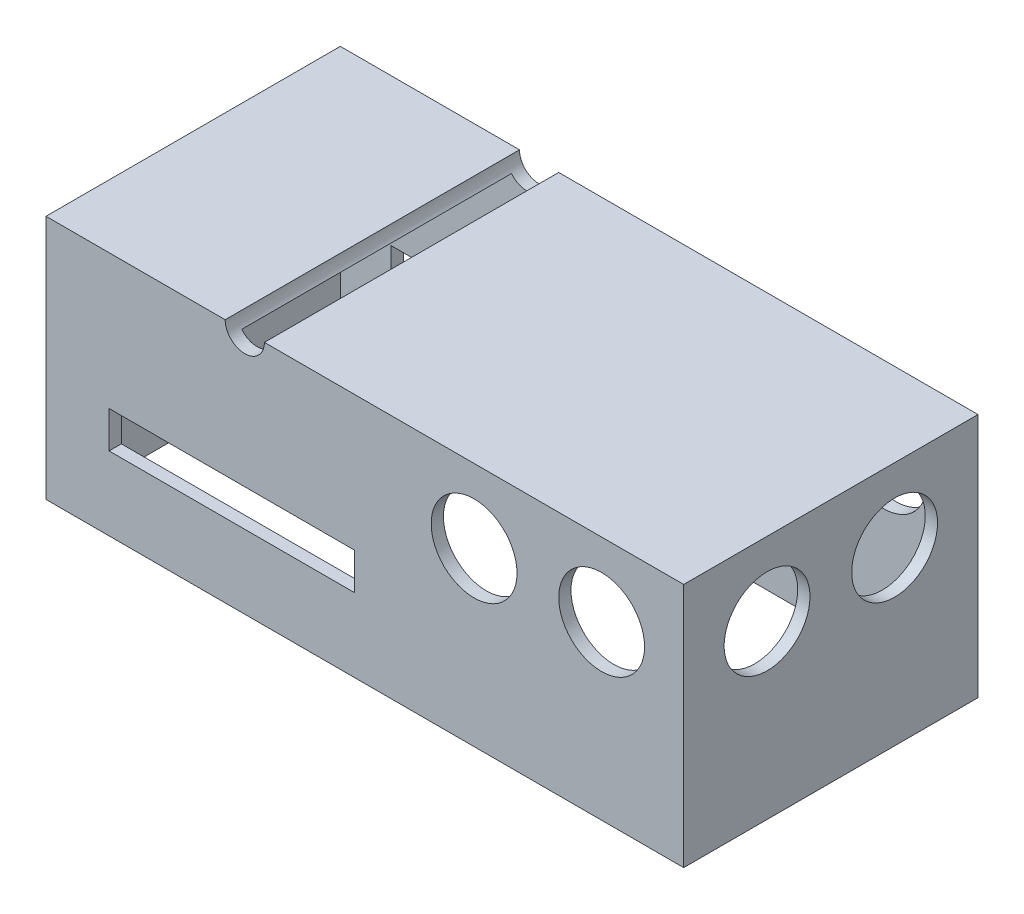
ISO-10303-21;
HEADER;
FILE_DESCRIPTION(('STEP AP214'),'2;1');
FILE_NAME('part.step','',(''),(''),'','','');
FILE_SCHEMA(('AUTOMOTIVE_DESIGN { 1 0 10303 214 1 1 1 1 }'));
ENDSEC;
DATA;
#1=APPLICATION_CONTEXT('core data for automotive mechanical design processes');
#2=APPLICATION_PROTOCOL_DEFINITION('international standard','automotive_design',2000,#1);
#3=PRODUCT_CONTEXT('',#1,'mechanical');
#4=PRODUCT('Part','Part','',(#3));
#5=PRODUCT_RELATED_PRODUCT_CATEGORY('part','',(#4));
#6=PRODUCT_DEFINITION_FORMATION('','',#4);
#7=PRODUCT_DEFINITION_CONTEXT('part definition',#1,'design');
#8=PRODUCT_DEFINITION('design','',#6,#7);
#9=PRODUCT_DEFINITION_SHAPE('','',#8);
#10=(LENGTH_UNIT() NAMED_UNIT(*) SI_UNIT(.MILLI.,.METRE.));
#11=(NAMED_UNIT(*) PLANE_ANGLE_UNIT() SI_UNIT($,.RADIAN.));
#12=(NAMED_UNIT(*) SI_UNIT($,.STERADIAN.) SOLID_ANGLE_UNIT());
#13=UNCERTAINTY_MEASURE_WITH_UNIT(LENGTH_MEASURE(1.E-05),#10,'distance_accuracy_value','');
#14=(GEOMETRIC_REPRESENTATION_CONTEXT(3) GLOBAL_UNCERTAINTY_ASSIGNED_CONTEXT((#13)) GLOBAL_UNIT_ASSIGNED_CONTEXT((#10,
#11,#12)) REPRESENTATION_CONTEXT('',''));
#15=CARTESIAN_POINT('',(0.,0.,0.));
#16=DIRECTION('',(0.,0.,1.));
#17=DIRECTION('',(1.,0.,0.));
#18=AXIS2_PLACEMENT_3D('',#15,#16,#17);
#19=CARTESIAN_POINT('',(0.,50.,0.));
#20=DIRECTION('',(0.,1.,0.));
#21=DIRECTION('',(0.,0.,1.));
#22=AXIS2_PLACEMENT_3D('',#19,#20,#21);
#23=PLANE('',#22);
#24=DIRECTION('',(0.,0.,-1.));
#25=VECTOR('',#24,1.);
#26=CARTESIAN_POINT('',(-20.4757563553922,50.,30.));
#27=LINE('',#26,#25);
#28=CARTESIAN_POINT('',(-20.4757563553922,50.,30.));
#29=VERTEX_POINT('',#28);
#30=CARTESIAN_POINT('',(-20.4757563553922,50.,-30.));
#31=VERTEX_POINT('',#30);
#32=EDGE_CURVE('E176',#29,#31,#27,.T.);
#33=ORIENTED_EDGE('',*,*,#32,.F.);
#34=DIRECTION('',(1.,0.,0.));
#35=VECTOR('',#34,1.);
#36=CARTESIAN_POINT('',(65.,50.,30.));
#37=LINE('',#36,#35);
#38=CARTESIAN_POINT('',(65.,50.,30.));
#39=VERTEX_POINT('',#38);
#40=EDGE_CURVE('E185',#29,#39,#37,.T.);
#41=ORIENTED_EDGE('',*,*,#40,.T.);
#42=DIRECTION('',(0.,0.,-1.));
#43=VECTOR('',#42,1.);
#44=CARTESIAN_POINT('',(65.,50.,30.));
#45=LINE('',#44,#43);
#46=CARTESIAN_POINT('',(65.,50.,-30.));
#47=VERTEX_POINT('',#46);
#48=EDGE_CURVE('E191',#39,#47,#45,.T.);
#49=ORIENTED_EDGE('',*,*,#48,.T.);
#50=DIRECTION('',(-1.,0.,0.));
#51=VECTOR('',#50,1.);
#52=CARTESIAN_POINT('',(65.,50.,-30.));
#53=LINE('',#52,#51);
#54=EDGE_CURVE('E198',#47,#31,#53,.T.);
#55=ORIENTED_EDGE('',*,*,#54,.T.);
#56=EDGE_LOOP('',(#33,#41,#49,#55));
#57=FACE_BOUND('',#56,.T.);
#58=ADVANCED_FACE('F33',(#57),#23,.T.);
#59=CARTESIAN_POINT('',(0.,47.5,0.));
#60=DIRECTION('',(0.,1.,0.));
#61=DIRECTION('',(0.,0.,1.));
#62=AXIS2_PLACEMENT_3D('',#59,#60,#61);
#63=PLANE('',#62);
#64=DIRECTION('',(1.,0.,0.));
#65=VECTOR('',#64,1.);
#66=CARTESIAN_POINT('',(65.,47.5,27.5));
#67=LINE('',#66,#65);
#68=CARTESIAN_POINT('',(-21.353257356193,47.5,27.5));
#69=VERTEX_POINT('',#68);
#70=CARTESIAN_POINT('',(62.5,47.5,27.5));
#71=VERTEX_POINT('',#70);
#72=EDGE_CURVE('E256',#69,#71,#67,.T.);
#73=ORIENTED_EDGE('',*,*,#72,.F.);
#74=DIRECTION('',(0.,0.,-1.));
#75=VECTOR('',#74,1.);
#76=CARTESIAN_POINT('',(-21.353257356193,47.5,30.));
#77=LINE('',#76,#75);
#78=CARTESIAN_POINT('',(-21.353257356193,47.5,-27.5));
#79=VERTEX_POINT('',#78);
#80=EDGE_CURVE('E11',#69,#79,#77,.T.);
#81=ORIENTED_EDGE('',*,*,#80,.T.);
#82=DIRECTION('',(-1.,0.,0.));
#83=VECTOR('',#82,1.);
#84=CARTESIAN_POINT('',(65.,47.5,-27.5));
#85=LINE('',#84,#83);
#86=CARTESIAN_POINT('',(62.5,47.5,-27.5));
#87=VERTEX_POINT('',#86);
#88=EDGE_CURVE('E267',#87,#79,#85,.T.);
#89=ORIENTED_EDGE('',*,*,#88,.F.);
#90=DIRECTION('',(0.,0.,-1.));
#91=VECTOR('',#90,1.);
#92=CARTESIAN_POINT('',(62.5,47.5,30.));
#93=LINE('',#92,#91);
#94=EDGE_CURVE('E255',#71,#87,#93,.T.);
#95=ORIENTED_EDGE('',*,*,#94,.F.);
#96=EDGE_LOOP('',(#73,#81,#89,#95));
#97=FACE_BOUND('',#96,.T.);
#98=ADVANCED_FACE('F392',(#97),#63,.F.);
#99=CARTESIAN_POINT('',(-65.,50.,30.));
#100=DIRECTION('',(1.,0.,0.));
#101=DIRECTION('',(0.,0.,-1.));
#102=AXIS2_PLACEMENT_3D('',#99,#100,#101);
#103=PLANE('',#102);
#104=DIRECTION('',(0.,0.,1.));
#105=VECTOR('',#104,1.);
#106=CARTESIAN_POINT('',(-65.,0.,30.));
#107=LINE('',#106,#105);
#108=CARTESIAN_POINT('',(-65.,0.,-30.));
#109=VERTEX_POINT('',#108);
#110=CARTESIAN_POINT('',(-65.,0.,30.));
#111=VERTEX_POINT('',#110);
#112=EDGE_CURVE('E202',#109,#111,#107,.T.);
#113=ORIENTED_EDGE('',*,*,#112,.T.);
#114=DIRECTION('',(0.,-1.,0.));
#115=VECTOR('',#114,1.);
#116=CARTESIAN_POINT('',(-65.,50.,30.));
#117=LINE('',#116,#115);
#118=CARTESIAN_POINT('',(-65.,50.,30.));
#119=VERTEX_POINT('',#118);
#120=EDGE_CURVE('E220',#119,#111,#117,.T.);
#121=ORIENTED_EDGE('',*,*,#120,.F.);
#122=DIRECTION('',(0.,0.,1.));
#123=VECTOR('',#122,1.);
#124=CARTESIAN_POINT('',(-65.,50.,30.));
#125=LINE('',#124,#123);
#126=CARTESIAN_POINT('',(-65.,50.,-30.));
#127=VERTEX_POINT('',#126);
#128=EDGE_CURVE('E189',#127,#119,#125,.T.);
#129=ORIENTED_EDGE('',*,*,#128,.F.);
#130=DIRECTION('',(0.,-1.,0.));
#131=VECTOR('',#130,1.);
#132=CARTESIAN_POINT('',(-65.,50.,-30.));
#133=LINE('',#132,#131);
#134=EDGE_CURVE('E201',#127,#109,#133,.T.);
#135=ORIENTED_EDGE('',*,*,#134,.T.);
#136=EDGE_LOOP('',(#113,#121,#129,#135));
#137=FACE_BOUND('',#136,.T.);
#138=ADVANCED_FACE('F35',(#137),#103,.F.);
#139=CARTESIAN_POINT('',(65.,50.,30.));
#140=DIRECTION('',(0.,0.,-1.));
#141=DIRECTION('',(-1.,0.,0.));
#142=AXIS2_PLACEMENT_3D('',#139,#140,#141);
#143=PLANE('',#142);
#144=DIRECTION('',(1.,0.,0.));
#145=VECTOR('',#144,1.);
#146=CARTESIAN_POINT('',(-2.14067208269808,22.5,30.));
#147=LINE('',#146,#145);
#148=CARTESIAN_POINT('',(-52.1406720826981,22.5,30.));
#149=VERTEX_POINT('',#148);
#150=CARTESIAN_POINT('',(-2.14067208269808,22.5,30.));
#151=VERTEX_POINT('',#150);
#152=EDGE_CURVE('E316',#149,#151,#147,.T.);
#153=ORIENTED_EDGE('',*,*,#152,.T.);
#154=DIRECTION('',(0.,-1.,0.));
#155=VECTOR('',#154,1.);
#156=CARTESIAN_POINT('',(-2.14067208269808,22.5,30.));
#157=LINE('',#156,#155);
#158=CARTESIAN_POINT('',(-2.14067208269809,15.,30.));
#159=VERTEX_POINT('',#158);
#160=EDGE_CURVE('E306',#151,#159,#157,.T.);
#161=ORIENTED_EDGE('',*,*,#160,.T.);
#162=DIRECTION('',(-1.,0.,0.));
#163=VECTOR('',#162,1.);
#164=CARTESIAN_POINT('',(-2.14067208269809,15.,30.));
#165=LINE('',#164,#163);
#166=CARTESIAN_POINT('',(-52.1406720826981,15.,30.));
#167=VERTEX_POINT('',#166);
#168=EDGE_CURVE('E309',#159,#167,#165,.T.);
#169=ORIENTED_EDGE('',*,*,#168,.T.);
#170=DIRECTION('',(0.,1.,0.));
#171=VECTOR('',#170,1.);
#172=CARTESIAN_POINT('',(-52.1406720826981,22.5,30.));
#173=LINE('',#172,#171);
#174=EDGE_CURVE('E313',#167,#149,#173,.T.);
#175=ORIENTED_EDGE('',*,*,#174,.T.);
#176=EDGE_LOOP('',(#153,#161,#169,#175));
#177=FACE_BOUND('',#176,.T.);
#178=CARTESIAN_POINT('',(48.2742436446079,35.,30.));
#179=DIRECTION('',(0.,0.,1.));
#180=DIRECTION('',(1.,0.,0.));
#181=AXIS2_PLACEMENT_3D('',#178,#179,#180);
#182=CIRCLE('',#181,8.75);
#183=CARTESIAN_POINT('',(57.0242436446079,35.,30.));
#184=VERTEX_POINT('',#183);
#185=EDGE_CURVE('E352',#184,#184,#182,.T.);
#186=ORIENTED_EDGE('',*,*,#185,.F.);
#187=EDGE_LOOP('',(#186));
#188=FACE_BOUND('',#187,.T.);
#189=CARTESIAN_POINT('',(22.2742436446078,35.,30.));
#190=DIRECTION('',(0.,0.,1.));
#191=DIRECTION('',(1.,0.,0.));
#192=AXIS2_PLACEMENT_3D('',#189,#190,#191);
#193=CIRCLE('',#192,8.75);
#194=CARTESIAN_POINT('',(31.0242436446078,35.,30.));
#195=VERTEX_POINT('',#194);
#196=EDGE_CURVE('E359',#195,#195,#193,.T.);
#197=ORIENTED_EDGE('',*,*,#196,.F.);
#198=EDGE_LOOP('',(#197));
#199=FACE_BOUND('',#198,.T.);
#200=ORIENTED_EDGE('',*,*,#40,.F.);
#201=CARTESIAN_POINT('',(-24.4757563553922,50.,30.));
#202=DIRECTION('',(0.,0.,-1.));
#203=DIRECTION('',(-1.,0.,0.));
#204=AXIS2_PLACEMENT_3D('',#201,#202,#203);
#205=CIRCLE('',#204,4.);
#206=CARTESIAN_POINT('',(-28.4757563553921,50.,30.));
#207=VERTEX_POINT('',#206);
#208=EDGE_CURVE('E170',#29,#207,#205,.T.);
#209=ORIENTED_EDGE('',*,*,#208,.T.);
#210=EDGE_CURVE('E182',#119,#207,#37,.T.);
#211=ORIENTED_EDGE('',*,*,#210,.F.);
#212=ORIENTED_EDGE('',*,*,#120,.T.);
#213=DIRECTION('',(1.,0.,0.));
#214=VECTOR('',#213,1.);
#215=CARTESIAN_POINT('',(65.,0.,30.));
#216=LINE('',#215,#214);
#217=CARTESIAN_POINT('',(65.,0.,30.));
#218=VERTEX_POINT('',#217);
#219=EDGE_CURVE('E205',#111,#218,#216,.T.);
#220=ORIENTED_EDGE('',*,*,#219,.T.);
#221=DIRECTION('',(0.,-1.,0.));
#222=VECTOR('',#221,1.);
#223=CARTESIAN_POINT('',(65.,50.,30.));
#224=LINE('',#223,#222);
#225=EDGE_CURVE('E217',#39,#218,#224,.T.);
#226=ORIENTED_EDGE('',*,*,#225,.F.);
#227=EDGE_LOOP('',(#200,#209,#211,#212,#220,#226));
#228=FACE_BOUND('',#227,.T.);
#229=ADVANCED_FACE('F180',(#177,#188,#199,#228),#143,.F.);
#230=CARTESIAN_POINT('',(65.,50.,30.));
#231=DIRECTION('',(-1.,0.,0.));
#232=DIRECTION('',(0.,0.,1.));
#233=AXIS2_PLACEMENT_3D('',#230,#231,#232);
#234=PLANE('',#233);
#235=CARTESIAN_POINT('',(65.,35.,-13.));
#236=DIRECTION('',(1.,0.,0.));
#237=DIRECTION('',(0.,0.,-1.));
#238=AXIS2_PLACEMENT_3D('',#235,#236,#237);
#239=CIRCLE('',#238,8.75);
#240=CARTESIAN_POINT('',(65.,35.,-21.75));
#241=VERTEX_POINT('',#240);
#242=EDGE_CURVE('E367',#241,#241,#239,.T.);
#243=ORIENTED_EDGE('',*,*,#242,.F.);
#244=EDGE_LOOP('',(#243));
#245=FACE_BOUND('',#244,.T.);
#246=CARTESIAN_POINT('',(65.,35.,13.));
#247=DIRECTION('',(1.,0.,0.));
#248=DIRECTION('',(0.,0.,-1.));
#249=AXIS2_PLACEMENT_3D('',#246,#247,#248);
#250=CIRCLE('',#249,8.75);
#251=CARTESIAN_POINT('',(65.,35.,4.25));
#252=VERTEX_POINT('',#251);
#253=EDGE_CURVE('E274',#252,#252,#250,.T.);
#254=ORIENTED_EDGE('',*,*,#253,.F.);
#255=EDGE_LOOP('',(#254));
#256=FACE_BOUND('',#255,.T.);
#257=DIRECTION('',(0.,0.,-1.));
#258=VECTOR('',#257,1.);
#259=CARTESIAN_POINT('',(65.,0.,30.));
#260=LINE('',#259,#258);
#261=CARTESIAN_POINT('',(65.,0.,-30.));
#262=VERTEX_POINT('',#261);
#263=EDGE_CURVE('E208',#218,#262,#260,.T.);
#264=ORIENTED_EDGE('',*,*,#263,.T.);
#265=DIRECTION('',(0.,-1.,0.));
#266=VECTOR('',#265,1.);
#267=CARTESIAN_POINT('',(65.,50.,-30.));
#268=LINE('',#267,#266);
#269=EDGE_CURVE('E214',#47,#262,#268,.T.);
#270=ORIENTED_EDGE('',*,*,#269,.F.);
#271=ORIENTED_EDGE('',*,*,#48,.F.);
#272=ORIENTED_EDGE('',*,*,#225,.T.);
#273=EDGE_LOOP('',(#264,#270,#271,#272));
#274=FACE_BOUND('',#273,.T.);
#275=ADVANCED_FACE('F408',(#245,#256,#274),#234,.F.);
#276=CARTESIAN_POINT('',(65.,50.,-30.));
#277=DIRECTION('',(0.,0.,1.));
#278=DIRECTION('',(1.,0.,0.));
#279=AXIS2_PLACEMENT_3D('',#276,#277,#278);
#280=PLANE('',#279);
#281=DIRECTION('',(-1.,0.,0.));
#282=VECTOR('',#281,1.);
#283=CARTESIAN_POINT('',(-2.14067208269809,15.,-30.));
#284=LINE('',#283,#282);
#285=CARTESIAN_POINT('',(-2.14067208269809,15.,-30.));
#286=VERTEX_POINT('',#285);
#287=CARTESIAN_POINT('',(-52.1406720826981,15.,-30.));
#288=VERTEX_POINT('',#287);
#289=EDGE_CURVE('E321',#286,#288,#284,.T.);
#290=ORIENTED_EDGE('',*,*,#289,.F.);
#291=DIRECTION('',(0.,-1.,0.));
#292=VECTOR('',#291,1.);
#293=CARTESIAN_POINT('',(-2.14067208269809,22.5,-30.));
#294=LINE('',#293,#292);
#295=CARTESIAN_POINT('',(-2.14067208269809,22.5,-30.));
#296=VERTEX_POINT('',#295);
#297=EDGE_CURVE('E302',#296,#286,#294,.T.);
#298=ORIENTED_EDGE('',*,*,#297,.F.);
#299=DIRECTION('',(1.,0.,0.));
#300=VECTOR('',#299,1.);
#301=CARTESIAN_POINT('',(-2.14067208269809,22.5,-30.));
#302=LINE('',#301,#300);
#303=CARTESIAN_POINT('',(-52.1406720826981,22.5,-30.));
#304=VERTEX_POINT('',#303);
#305=EDGE_CURVE('E310',#304,#296,#302,.T.);
#306=ORIENTED_EDGE('',*,*,#305,.F.);
#307=DIRECTION('',(0.,1.,0.));
#308=VECTOR('',#307,1.);
#309=CARTESIAN_POINT('',(-52.1406720826981,22.5,-30.));
#310=LINE('',#309,#308);
#311=EDGE_CURVE('E324',#288,#304,#310,.T.);
#312=ORIENTED_EDGE('',*,*,#311,.F.);
#313=EDGE_LOOP('',(#290,#298,#306,#312));
#314=FACE_BOUND('',#313,.T.);
#315=CARTESIAN_POINT('',(48.2742436446079,35.,-30.));
#316=DIRECTION('',(0.,0.,1.));
#317=DIRECTION('',(1.,0.,0.));
#318=AXIS2_PLACEMENT_3D('',#315,#316,#317);
#319=CIRCLE('',#318,8.75);
#320=CARTESIAN_POINT('',(57.0242436446079,35.,-30.));
#321=VERTEX_POINT('',#320);
#322=EDGE_CURVE('E232',#321,#321,#319,.T.);
#323=ORIENTED_EDGE('',*,*,#322,.T.);
#324=EDGE_LOOP('',(#323));
#325=FACE_BOUND('',#324,.T.);
#326=CARTESIAN_POINT('',(22.2742436446078,35.,-30.));
#327=DIRECTION('',(0.,0.,1.));
#328=DIRECTION('',(1.,0.,0.));
#329=AXIS2_PLACEMENT_3D('',#326,#327,#328);
#330=CIRCLE('',#329,8.75);
#331=CARTESIAN_POINT('',(31.0242436446078,35.,-30.));
#332=VERTEX_POINT('',#331);
#333=EDGE_CURVE('E227',#332,#332,#330,.T.);
#334=ORIENTED_EDGE('',*,*,#333,.T.);
#335=EDGE_LOOP('',(#334));
#336=FACE_BOUND('',#335,.T.);
#337=CARTESIAN_POINT('',(-28.4757563553921,50.,-30.));
#338=VERTEX_POINT('',#337);
#339=EDGE_CURVE('E193',#338,#127,#53,.T.);
#340=ORIENTED_EDGE('',*,*,#339,.F.);
#341=CARTESIAN_POINT('',(-24.4757563553922,50.,-30.));
#342=DIRECTION('',(0.,0.,-1.));
#343=DIRECTION('',(-1.,0.,0.));
#344=AXIS2_PLACEMENT_3D('',#341,#342,#343);
#345=CIRCLE('',#344,4.);
#346=EDGE_CURVE('E48',#31,#338,#345,.T.);
#347=ORIENTED_EDGE('',*,*,#346,.F.);
#348=ORIENTED_EDGE('',*,*,#54,.F.);
#349=ORIENTED_EDGE('',*,*,#269,.T.);
#350=DIRECTION('',(-1.,0.,0.));
#351=VECTOR('',#350,1.);
#352=CARTESIAN_POINT('',(65.,0.,-30.));
#353=LINE('',#352,#351);
#354=EDGE_CURVE('E210',#262,#109,#353,.T.);
#355=ORIENTED_EDGE('',*,*,#354,.T.);
#356=ORIENTED_EDGE('',*,*,#134,.F.);
#357=EDGE_LOOP('',(#340,#347,#348,#349,#355,#356));
#358=FACE_BOUND('',#357,.T.);
#359=ADVANCED_FACE('F403',(#314,#325,#336,#358),#280,.F.);
#360=DIRECTION('',(0.,0.,-1.));
#361=VECTOR('',#360,1.);
#362=CARTESIAN_POINT('',(-28.4757563553921,50.,30.));
#363=LINE('',#362,#361);
#364=EDGE_CURVE('E167',#207,#338,#363,.T.);
#365=ORIENTED_EDGE('',*,*,#364,.T.);
#366=ORIENTED_EDGE('',*,*,#339,.T.);
#367=ORIENTED_EDGE('',*,*,#128,.T.);
#368=ORIENTED_EDGE('',*,*,#210,.T.);
#369=EDGE_LOOP('',(#365,#366,#367,#368));
#370=FACE_BOUND('',#369,.T.);
#371=ADVANCED_FACE('F187',(#370),#23,.T.);
#372=CARTESIAN_POINT('',(0.,0.,0.));
#373=DIRECTION('',(0.,1.,0.));
#374=DIRECTION('',(0.,0.,1.));
#375=AXIS2_PLACEMENT_3D('',#372,#373,#374);
#376=PLANE('',#375);
#377=DIRECTION('',(-1.,0.,0.));
#378=VECTOR('',#377,1.);
#379=CARTESIAN_POINT('',(65.,0.,-27.5));
#380=LINE('',#379,#378);
#381=CARTESIAN_POINT('',(62.5,0.,-27.5));
#382=VERTEX_POINT('',#381);
#383=CARTESIAN_POINT('',(-62.5,0.,-27.5));
#384=VERTEX_POINT('',#383);
#385=EDGE_CURVE('E275',#382,#384,#380,.T.);
#386=ORIENTED_EDGE('',*,*,#385,.T.);
#387=DIRECTION('',(0.,0.,1.));
#388=VECTOR('',#387,1.);
#389=CARTESIAN_POINT('',(-62.5,0.,30.));
#390=LINE('',#389,#388);
#391=CARTESIAN_POINT('',(-62.5,0.,27.5));
#392=VERTEX_POINT('',#391);
#393=EDGE_CURVE('E270',#384,#392,#390,.T.);
#394=ORIENTED_EDGE('',*,*,#393,.T.);
#395=DIRECTION('',(1.,0.,0.));
#396=VECTOR('',#395,1.);
#397=CARTESIAN_POINT('',(65.,0.,27.5));
#398=LINE('',#397,#396);
#399=CARTESIAN_POINT('',(62.5,0.,27.5));
#400=VERTEX_POINT('',#399);
#401=EDGE_CURVE('E273',#392,#400,#398,.T.);
#402=ORIENTED_EDGE('',*,*,#401,.T.);
#403=DIRECTION('',(0.,0.,-1.));
#404=VECTOR('',#403,1.);
#405=CARTESIAN_POINT('',(62.5,0.,30.));
#406=LINE('',#405,#404);
#407=EDGE_CURVE('E278',#400,#382,#406,.T.);
#408=ORIENTED_EDGE('',*,*,#407,.T.);
#409=EDGE_LOOP('',(#386,#394,#402,#408));
#410=FACE_BOUND('',#409,.T.);
#411=ORIENTED_EDGE('',*,*,#112,.F.);
#412=ORIENTED_EDGE('',*,*,#354,.F.);
#413=ORIENTED_EDGE('',*,*,#263,.F.);
#414=ORIENTED_EDGE('',*,*,#219,.F.);
#415=EDGE_LOOP('',(#411,#412,#413,#414));
#416=FACE_BOUND('',#415,.T.);
#417=ADVANCED_FACE('F282',(#410,#416),#376,.F.);
#418=CARTESIAN_POINT('',(-62.5,50.,30.));
#419=DIRECTION('',(1.,0.,0.));
#420=DIRECTION('',(0.,0.,-1.));
#421=AXIS2_PLACEMENT_3D('',#418,#419,#420);
#422=PLANE('',#421);
#423=ORIENTED_EDGE('',*,*,#393,.F.);
#424=DIRECTION('',(0.,-1.,0.));
#425=VECTOR('',#424,1.);
#426=CARTESIAN_POINT('',(-62.5,50.,-27.5));
#427=LINE('',#426,#425);
#428=CARTESIAN_POINT('',(-62.5,47.5,-27.5));
#429=VERTEX_POINT('',#428);
#430=EDGE_CURVE('E265',#429,#384,#427,.T.);
#431=ORIENTED_EDGE('',*,*,#430,.F.);
#432=DIRECTION('',(0.,0.,1.));
#433=VECTOR('',#432,1.);
#434=CARTESIAN_POINT('',(-62.5,47.5,30.));
#435=LINE('',#434,#433);
#436=CARTESIAN_POINT('',(-62.5,47.5,27.5));
#437=VERTEX_POINT('',#436);
#438=EDGE_CURVE('E259',#429,#437,#435,.T.);
#439=ORIENTED_EDGE('',*,*,#438,.T.);
#440=DIRECTION('',(0.,-1.,0.));
#441=VECTOR('',#440,1.);
#442=CARTESIAN_POINT('',(-62.5,50.,27.5));
#443=LINE('',#442,#441);
#444=EDGE_CURVE('E206',#437,#392,#443,.T.);
#445=ORIENTED_EDGE('',*,*,#444,.T.);
#446=EDGE_LOOP('',(#423,#431,#439,#445));
#447=FACE_BOUND('',#446,.T.);
#448=ADVANCED_FACE('F288',(#447),#422,.T.);
#449=CARTESIAN_POINT('',(65.,50.,27.5));
#450=DIRECTION('',(0.,0.,-1.));
#451=DIRECTION('',(-1.,0.,0.));
#452=AXIS2_PLACEMENT_3D('',#449,#450,#451);
#453=PLANE('',#452);
#454=CARTESIAN_POINT('',(-24.4757563553922,50.,27.5));
#455=DIRECTION('',(0.,0.,-1.));
#456=DIRECTION('',(-1.,0.,0.));
#457=AXIS2_PLACEMENT_3D('',#454,#455,#456);
#458=CIRCLE('',#457,4.);
#459=CARTESIAN_POINT('',(-27.5982553545914,47.5,27.5));
#460=VERTEX_POINT('',#459);
#461=EDGE_CURVE('E56',#69,#460,#458,.T.);
#462=ORIENTED_EDGE('',*,*,#461,.F.);
#463=ORIENTED_EDGE('',*,*,#72,.T.);
#464=DIRECTION('',(0.,-1.,0.));
#465=VECTOR('',#464,1.);
#466=CARTESIAN_POINT('',(62.5,50.,27.5));
#467=LINE('',#466,#465);
#468=EDGE_CURVE('E262',#71,#400,#467,.T.);
#469=ORIENTED_EDGE('',*,*,#468,.T.);
#470=ORIENTED_EDGE('',*,*,#401,.F.);
#471=ORIENTED_EDGE('',*,*,#444,.F.);
#472=EDGE_CURVE('E245',#437,#460,#67,.T.);
#473=ORIENTED_EDGE('',*,*,#472,.T.);
#474=EDGE_LOOP('',(#462,#463,#469,#470,#471,#473));
#475=FACE_BOUND('',#474,.T.);
#476=DIRECTION('',(0.,-1.,0.));
#477=VECTOR('',#476,1.);
#478=CARTESIAN_POINT('',(-2.14067208269805,50.0000000000001,27.5));
#479=LINE('',#478,#477);
#480=CARTESIAN_POINT('',(-2.14067208269808,22.5,27.5));
#481=VERTEX_POINT('',#480);
#482=CARTESIAN_POINT('',(-2.14067208269809,15.,27.5));
#483=VERTEX_POINT('',#482);
#484=EDGE_CURVE('E349',#481,#483,#479,.T.);
#485=ORIENTED_EDGE('',*,*,#484,.F.);
#486=DIRECTION('',(1.,0.,0.));
#487=VECTOR('',#486,1.);
#488=CARTESIAN_POINT('',(65.,22.5,27.5));
#489=LINE('',#488,#487);
#490=CARTESIAN_POINT('',(-52.1406720826981,22.5,27.5));
#491=VERTEX_POINT('',#490);
#492=EDGE_CURVE('E347',#491,#481,#489,.T.);
#493=ORIENTED_EDGE('',*,*,#492,.F.);
#494=DIRECTION('',(0.,1.,0.));
#495=VECTOR('',#494,1.);
#496=CARTESIAN_POINT('',(-52.1406720826981,50.,27.5));
#497=LINE('',#496,#495);
#498=CARTESIAN_POINT('',(-52.1406720826981,15.,27.5));
#499=VERTEX_POINT('',#498);
#500=EDGE_CURVE('E345',#499,#491,#497,.T.);
#501=ORIENTED_EDGE('',*,*,#500,.F.);
#502=DIRECTION('',(-1.,0.,0.));
#503=VECTOR('',#502,1.);
#504=CARTESIAN_POINT('',(65.,15.,27.5));
#505=LINE('',#504,#503);
#506=EDGE_CURVE('E332',#483,#499,#505,.T.);
#507=ORIENTED_EDGE('',*,*,#506,.F.);
#508=EDGE_LOOP('',(#485,#493,#501,#507));
#509=FACE_BOUND('',#508,.T.);
#510=CARTESIAN_POINT('',(48.2742436446079,35.,27.5));
#511=DIRECTION('',(0.,0.,-1.));
#512=DIRECTION('',(-1.,0.,0.));
#513=AXIS2_PLACEMENT_3D('',#510,#511,#512);
#514=CIRCLE('',#513,8.75);
#515=CARTESIAN_POINT('',(39.5242436446079,35.,27.5));
#516=VERTEX_POINT('',#515);
#517=EDGE_CURVE('E231',#516,#516,#514,.T.);
#518=ORIENTED_EDGE('',*,*,#517,.F.);
#519=EDGE_LOOP('',(#518));
#520=FACE_BOUND('',#519,.T.);
#521=CARTESIAN_POINT('',(22.2742436446078,35.,27.5));
#522=DIRECTION('',(0.,0.,-1.));
#523=DIRECTION('',(-1.,0.,0.));
#524=AXIS2_PLACEMENT_3D('',#521,#522,#523);
#525=CIRCLE('',#524,8.75);
#526=CARTESIAN_POINT('',(13.5242436446078,35.,27.5));
#527=VERTEX_POINT('',#526);
#528=EDGE_CURVE('E226',#527,#527,#525,.T.);
#529=ORIENTED_EDGE('',*,*,#528,.F.);
#530=EDGE_LOOP('',(#529));
#531=FACE_BOUND('',#530,.T.);
#532=ADVANCED_FACE('F251',(#475,#509,#520,#531),#453,.T.);
#533=CARTESIAN_POINT('',(62.5,50.,30.));
#534=DIRECTION('',(-1.,0.,0.));
#535=DIRECTION('',(0.,0.,1.));
#536=AXIS2_PLACEMENT_3D('',#533,#534,#535);
#537=PLANE('',#536);
#538=CARTESIAN_POINT('',(62.5,35.,-13.));
#539=DIRECTION('',(-1.,0.,0.));
#540=DIRECTION('',(0.,0.,1.));
#541=AXIS2_PLACEMENT_3D('',#538,#539,#540);
#542=CIRCLE('',#541,8.75);
#543=CARTESIAN_POINT('',(62.5,35.,-4.25));
#544=VERTEX_POINT('',#543);
#545=EDGE_CURVE('E366',#544,#544,#542,.F.);
#546=ORIENTED_EDGE('',*,*,#545,.T.);
#547=EDGE_LOOP('',(#546));
#548=FACE_BOUND('',#547,.T.);
#549=CARTESIAN_POINT('',(62.5,35.,13.));
#550=DIRECTION('',(-1.,0.,0.));
#551=DIRECTION('',(0.,0.,1.));
#552=AXIS2_PLACEMENT_3D('',#549,#550,#551);
#553=CIRCLE('',#552,8.75);
#554=CARTESIAN_POINT('',(62.5,35.,21.75));
#555=VERTEX_POINT('',#554);
#556=EDGE_CURVE('E293',#555,#555,#553,.F.);
#557=ORIENTED_EDGE('',*,*,#556,.T.);
#558=EDGE_LOOP('',(#557));
#559=FACE_BOUND('',#558,.T.);
#560=ORIENTED_EDGE('',*,*,#407,.F.);
#561=ORIENTED_EDGE('',*,*,#468,.F.);
#562=ORIENTED_EDGE('',*,*,#94,.T.);
#563=DIRECTION('',(0.,-1.,0.));
#564=VECTOR('',#563,1.);
#565=CARTESIAN_POINT('',(62.5,50.,-27.5));
#566=LINE('',#565,#564);
#567=EDGE_CURVE('E264',#87,#382,#566,.T.);
#568=ORIENTED_EDGE('',*,*,#567,.T.);
#569=EDGE_LOOP('',(#560,#561,#562,#568));
#570=FACE_BOUND('',#569,.T.);
#571=ADVANCED_FACE('F377',(#548,#559,#570),#537,.T.);
#572=CARTESIAN_POINT('',(65.,50.,-27.5));
#573=DIRECTION('',(0.,0.,1.));
#574=DIRECTION('',(1.,0.,0.));
#575=AXIS2_PLACEMENT_3D('',#572,#573,#574);
#576=PLANE('',#575);
#577=CARTESIAN_POINT('',(-24.4757563553922,50.,-27.5));
#578=DIRECTION('',(0.,0.,1.));
#579=DIRECTION('',(1.,0.,0.));
#580=AXIS2_PLACEMENT_3D('',#577,#578,#579);
#581=CIRCLE('',#580,4.);
#582=CARTESIAN_POINT('',(-27.5982553545914,47.5,-27.5));
#583=VERTEX_POINT('',#582);
#584=EDGE_CURVE('E175',#583,#79,#581,.T.);
#585=ORIENTED_EDGE('',*,*,#584,.F.);
#586=EDGE_CURVE('E247',#583,#429,#85,.T.);
#587=ORIENTED_EDGE('',*,*,#586,.T.);
#588=ORIENTED_EDGE('',*,*,#430,.T.);
#589=ORIENTED_EDGE('',*,*,#385,.F.);
#590=ORIENTED_EDGE('',*,*,#567,.F.);
#591=ORIENTED_EDGE('',*,*,#88,.T.);
#592=EDGE_LOOP('',(#585,#587,#588,#589,#590,#591));
#593=FACE_BOUND('',#592,.T.);
#594=DIRECTION('',(0.,1.,0.));
#595=VECTOR('',#594,1.);
#596=CARTESIAN_POINT('',(-2.14067208269805,50.0000000000001,-27.5));
#597=LINE('',#596,#595);
#598=CARTESIAN_POINT('',(-2.14067208269809,15.,-27.5));
#599=VERTEX_POINT('',#598);
#600=CARTESIAN_POINT('',(-2.14067208269809,22.5,-27.5));
#601=VERTEX_POINT('',#600);
#602=EDGE_CURVE('E239',#599,#601,#597,.T.);
#603=ORIENTED_EDGE('',*,*,#602,.F.);
#604=DIRECTION('',(1.,0.,0.));
#605=VECTOR('',#604,1.);
#606=CARTESIAN_POINT('',(65.,15.,-27.5));
#607=LINE('',#606,#605);
#608=CARTESIAN_POINT('',(-52.1406720826981,15.,-27.5));
#609=VERTEX_POINT('',#608);
#610=EDGE_CURVE('E222',#609,#599,#607,.T.);
#611=ORIENTED_EDGE('',*,*,#610,.F.);
#612=DIRECTION('',(0.,-1.,0.));
#613=VECTOR('',#612,1.);
#614=CARTESIAN_POINT('',(-52.1406720826981,50.,-27.5));
#615=LINE('',#614,#613);
#616=CARTESIAN_POINT('',(-52.1406720826981,22.5,-27.5));
#617=VERTEX_POINT('',#616);
#618=EDGE_CURVE('E234',#617,#609,#615,.T.);
#619=ORIENTED_EDGE('',*,*,#618,.F.);
#620=DIRECTION('',(-1.,0.,0.));
#621=VECTOR('',#620,1.);
#622=CARTESIAN_POINT('',(65.,22.5,-27.5));
#623=LINE('',#622,#621);
#624=EDGE_CURVE('E237',#601,#617,#623,.T.);
#625=ORIENTED_EDGE('',*,*,#624,.F.);
#626=EDGE_LOOP('',(#603,#611,#619,#625));
#627=FACE_BOUND('',#626,.T.);
#628=CARTESIAN_POINT('',(48.2742436446079,35.,-27.5));
#629=DIRECTION('',(0.,0.,1.));
#630=DIRECTION('',(1.,0.,0.));
#631=AXIS2_PLACEMENT_3D('',#628,#629,#630);
#632=CIRCLE('',#631,8.75);
#633=CARTESIAN_POINT('',(57.0242436446079,35.,-27.5));
#634=VERTEX_POINT('',#633);
#635=EDGE_CURVE('E228',#634,#634,#632,.T.);
#636=ORIENTED_EDGE('',*,*,#635,.F.);
#637=EDGE_LOOP('',(#636));
#638=FACE_BOUND('',#637,.T.);
#639=CARTESIAN_POINT('',(22.2742436446078,35.,-27.5));
#640=DIRECTION('',(0.,0.,1.));
#641=DIRECTION('',(1.,0.,0.));
#642=AXIS2_PLACEMENT_3D('',#639,#640,#641);
#643=CIRCLE('',#642,8.75);
#644=CARTESIAN_POINT('',(31.0242436446078,35.,-27.5));
#645=VERTEX_POINT('',#644);
#646=EDGE_CURVE('E223',#645,#645,#643,.T.);
#647=ORIENTED_EDGE('',*,*,#646,.F.);
#648=EDGE_LOOP('',(#647));
#649=FACE_BOUND('',#648,.T.);
#650=ADVANCED_FACE('F297',(#593,#627,#638,#649),#576,.T.);
#651=ORIENTED_EDGE('',*,*,#586,.F.);
#652=DIRECTION('',(0.,0.,-1.));
#653=VECTOR('',#652,1.);
#654=CARTESIAN_POINT('',(-27.5982553545914,47.5,30.));
#655=LINE('',#654,#653);
#656=EDGE_CURVE('E41',#583,#460,#655,.F.);
#657=ORIENTED_EDGE('',*,*,#656,.T.);
#658=ORIENTED_EDGE('',*,*,#472,.F.);
#659=ORIENTED_EDGE('',*,*,#438,.F.);
#660=EDGE_LOOP('',(#651,#657,#658,#659));
#661=FACE_BOUND('',#660,.T.);
#662=ADVANCED_FACE('F243',(#661),#63,.F.);
#663=CARTESIAN_POINT('',(-65.001,35.,13.));
#664=DIRECTION('',(1.,0.,0.));
#665=DIRECTION('',(0.,0.,-1.));
#666=AXIS2_PLACEMENT_3D('',#663,#664,#665);
#667=CYLINDRICAL_SURFACE('',#666,8.75);
#668=ORIENTED_EDGE('',*,*,#556,.F.);
#669=EDGE_LOOP('',(#668));
#670=FACE_BOUND('',#669,.T.);
#671=ORIENTED_EDGE('',*,*,#253,.T.);
#672=EDGE_LOOP('',(#671));
#673=FACE_BOUND('',#672,.T.);
#674=ADVANCED_FACE('F380',(#670,#673),#667,.F.);
#675=CARTESIAN_POINT('',(-65.001,35.,-13.));
#676=DIRECTION('',(1.,0.,0.));
#677=DIRECTION('',(0.,0.,-1.));
#678=AXIS2_PLACEMENT_3D('',#675,#676,#677);
#679=CYLINDRICAL_SURFACE('',#678,8.75);
#680=ORIENTED_EDGE('',*,*,#545,.F.);
#681=EDGE_LOOP('',(#680));
#682=FACE_BOUND('',#681,.T.);
#683=ORIENTED_EDGE('',*,*,#242,.T.);
#684=EDGE_LOOP('',(#683));
#685=FACE_BOUND('',#684,.T.);
#686=ADVANCED_FACE('F382',(#682,#685),#679,.F.);
#687=CARTESIAN_POINT('',(22.2742436446078,35.,-30.));
#688=DIRECTION('',(0.,0.,1.));
#689=DIRECTION('',(1.,0.,0.));
#690=AXIS2_PLACEMENT_3D('',#687,#688,#689);
#691=CYLINDRICAL_SURFACE('',#690,8.75);
#692=ORIENTED_EDGE('',*,*,#646,.T.);
#693=EDGE_LOOP('',(#692));
#694=FACE_BOUND('',#693,.T.);
#695=ORIENTED_EDGE('',*,*,#333,.F.);
#696=EDGE_LOOP('',(#695));
#697=FACE_BOUND('',#696,.T.);
#698=ADVANCED_FACE('F388',(#694,#697),#691,.F.);
#699=ORIENTED_EDGE('',*,*,#528,.T.);
#700=EDGE_LOOP('',(#699));
#701=FACE_BOUND('',#700,.T.);
#702=ORIENTED_EDGE('',*,*,#196,.T.);
#703=EDGE_LOOP('',(#702));
#704=FACE_BOUND('',#703,.T.);
#705=ADVANCED_FACE('F430',(#701,#704),#691,.F.);
#706=CARTESIAN_POINT('',(48.2742436446079,35.,-30.));
#707=DIRECTION('',(0.,0.,1.));
#708=DIRECTION('',(1.,0.,0.));
#709=AXIS2_PLACEMENT_3D('',#706,#707,#708);
#710=CYLINDRICAL_SURFACE('',#709,8.75);
#711=ORIENTED_EDGE('',*,*,#635,.T.);
#712=EDGE_LOOP('',(#711));
#713=FACE_BOUND('',#712,.T.);
#714=ORIENTED_EDGE('',*,*,#322,.F.);
#715=EDGE_LOOP('',(#714));
#716=FACE_BOUND('',#715,.T.);
#717=ADVANCED_FACE('F432',(#713,#716),#710,.F.);
#718=ORIENTED_EDGE('',*,*,#517,.T.);
#719=EDGE_LOOP('',(#718));
#720=FACE_BOUND('',#719,.T.);
#721=ORIENTED_EDGE('',*,*,#185,.T.);
#722=EDGE_LOOP('',(#721));
#723=FACE_BOUND('',#722,.T.);
#724=ADVANCED_FACE('F439',(#720,#723),#710,.F.);
#725=CARTESIAN_POINT('',(-2.14067208269809,15.,30.));
#726=DIRECTION('',(0.,-1.,0.));
#727=DIRECTION('',(1.,0.,0.));
#728=AXIS2_PLACEMENT_3D('',#725,#726,#727);
#729=PLANE('',#728);
#730=ORIENTED_EDGE('',*,*,#610,.T.);
#731=DIRECTION('',(0.,0.,-1.));
#732=VECTOR('',#731,1.);
#733=CARTESIAN_POINT('',(-2.14067208269809,15.,30.));
#734=LINE('',#733,#732);
#735=EDGE_CURVE('E319',#599,#286,#734,.T.);
#736=ORIENTED_EDGE('',*,*,#735,.T.);
#737=ORIENTED_EDGE('',*,*,#289,.T.);
#738=DIRECTION('',(0.,0.,-1.));
#739=VECTOR('',#738,1.);
#740=CARTESIAN_POINT('',(-52.1406720826981,15.,30.));
#741=LINE('',#740,#739);
#742=EDGE_CURVE('E341',#609,#288,#741,.T.);
#743=ORIENTED_EDGE('',*,*,#742,.F.);
#744=EDGE_LOOP('',(#730,#736,#737,#743));
#745=FACE_BOUND('',#744,.T.);
#746=ADVANCED_FACE('F450',(#745),#729,.F.);
#747=CARTESIAN_POINT('',(-52.1406720826981,22.5,30.));
#748=DIRECTION('',(-1.,0.,0.));
#749=DIRECTION('',(0.,0.,1.));
#750=AXIS2_PLACEMENT_3D('',#747,#748,#749);
#751=PLANE('',#750);
#752=ORIENTED_EDGE('',*,*,#618,.T.);
#753=ORIENTED_EDGE('',*,*,#742,.T.);
#754=ORIENTED_EDGE('',*,*,#311,.T.);
#755=DIRECTION('',(0.,0.,-1.));
#756=VECTOR('',#755,1.);
#757=CARTESIAN_POINT('',(-52.1406720826981,22.5,30.));
#758=LINE('',#757,#756);
#759=EDGE_CURVE('E337',#617,#304,#758,.T.);
#760=ORIENTED_EDGE('',*,*,#759,.F.);
#761=EDGE_LOOP('',(#752,#753,#754,#760));
#762=FACE_BOUND('',#761,.T.);
#763=ADVANCED_FACE('F453',(#762),#751,.F.);
#764=CARTESIAN_POINT('',(-2.14067208269808,22.5,30.));
#765=DIRECTION('',(0.,1.,0.));
#766=DIRECTION('',(-1.,0.,0.));
#767=AXIS2_PLACEMENT_3D('',#764,#765,#766);
#768=PLANE('',#767);
#769=ORIENTED_EDGE('',*,*,#624,.T.);
#770=ORIENTED_EDGE('',*,*,#759,.T.);
#771=ORIENTED_EDGE('',*,*,#305,.T.);
#772=DIRECTION('',(0.,0.,-1.));
#773=VECTOR('',#772,1.);
#774=CARTESIAN_POINT('',(-2.14067208269808,22.5,30.));
#775=LINE('',#774,#773);
#776=EDGE_CURVE('E333',#601,#296,#775,.T.);
#777=ORIENTED_EDGE('',*,*,#776,.F.);
#778=EDGE_LOOP('',(#769,#770,#771,#777));
#779=FACE_BOUND('',#778,.T.);
#780=ADVANCED_FACE('F448',(#779),#768,.F.);
#781=CARTESIAN_POINT('',(-2.14067208269808,22.5,30.));
#782=DIRECTION('',(1.,0.,0.));
#783=DIRECTION('',(0.,1.,0.));
#784=AXIS2_PLACEMENT_3D('',#781,#782,#783);
#785=PLANE('',#784);
#786=ORIENTED_EDGE('',*,*,#602,.T.);
#787=ORIENTED_EDGE('',*,*,#776,.T.);
#788=ORIENTED_EDGE('',*,*,#297,.T.);
#789=ORIENTED_EDGE('',*,*,#735,.F.);
#790=EDGE_LOOP('',(#786,#787,#788,#789));
#791=FACE_BOUND('',#790,.T.);
#792=ADVANCED_FACE('F444',(#791),#785,.F.);
#793=ORIENTED_EDGE('',*,*,#484,.T.);
#794=EDGE_CURVE('E342',#159,#483,#734,.T.);
#795=ORIENTED_EDGE('',*,*,#794,.F.);
#796=ORIENTED_EDGE('',*,*,#160,.F.);
#797=EDGE_CURVE('E329',#151,#481,#775,.T.);
#798=ORIENTED_EDGE('',*,*,#797,.T.);
#799=EDGE_LOOP('',(#793,#795,#796,#798));
#800=FACE_BOUND('',#799,.T.);
#801=ADVANCED_FACE('F447',(#800),#785,.F.);
#802=ORIENTED_EDGE('',*,*,#492,.T.);
#803=ORIENTED_EDGE('',*,*,#797,.F.);
#804=ORIENTED_EDGE('',*,*,#152,.F.);
#805=EDGE_CURVE('E334',#149,#491,#758,.T.);
#806=ORIENTED_EDGE('',*,*,#805,.T.);
#807=EDGE_LOOP('',(#802,#803,#804,#806));
#808=FACE_BOUND('',#807,.T.);
#809=ADVANCED_FACE('F463',(#808),#768,.F.);
#810=ORIENTED_EDGE('',*,*,#500,.T.);
#811=ORIENTED_EDGE('',*,*,#805,.F.);
#812=ORIENTED_EDGE('',*,*,#174,.F.);
#813=EDGE_CURVE('E338',#167,#499,#741,.T.);
#814=ORIENTED_EDGE('',*,*,#813,.T.);
#815=EDGE_LOOP('',(#810,#811,#812,#814));
#816=FACE_BOUND('',#815,.T.);
#817=ADVANCED_FACE('F459',(#816),#751,.F.);
#818=ORIENTED_EDGE('',*,*,#506,.T.);
#819=ORIENTED_EDGE('',*,*,#813,.F.);
#820=ORIENTED_EDGE('',*,*,#168,.F.);
#821=ORIENTED_EDGE('',*,*,#794,.T.);
#822=EDGE_LOOP('',(#818,#819,#820,#821));
#823=FACE_BOUND('',#822,.T.);
#824=ADVANCED_FACE('F455',(#823),#729,.F.);
#825=CARTESIAN_POINT('',(-24.4757563553922,50.,30.));
#826=DIRECTION('',(0.,0.,-1.));
#827=DIRECTION('',(-1.,0.,0.));
#828=AXIS2_PLACEMENT_3D('',#825,#826,#827);
#829=CYLINDRICAL_SURFACE('',#828,4.);
#830=ORIENTED_EDGE('',*,*,#346,.T.);
#831=ORIENTED_EDGE('',*,*,#364,.F.);
#832=ORIENTED_EDGE('',*,*,#208,.F.);
#833=ORIENTED_EDGE('',*,*,#32,.T.);
#834=EDGE_LOOP('',(#830,#831,#832,#833));
#835=FACE_BOUND('',#834,.T.);
#836=ORIENTED_EDGE('',*,*,#461,.T.);
#837=ORIENTED_EDGE('',*,*,#656,.F.);
#838=ORIENTED_EDGE('',*,*,#584,.T.);
#839=ORIENTED_EDGE('',*,*,#80,.F.);
#840=EDGE_LOOP('',(#836,#837,#838,#839));
#841=FACE_BOUND('',#840,.T.);
#842=ADVANCED_FACE('F169',(#835,#841),#829,.F.);
#843=CLOSED_SHELL('',(#58,#98,#138,#229,#275,#359,#371,#417,#448,#532,#571,#650,#662,#674,#686,
#698,#705,#717,#724,#746,#763,#780,#792,#801,#809,#817,#824,#842));
#844=MANIFOLD_SOLID_BREP('B2',#843);
#845=ADVANCED_BREP_SHAPE_REPRESENTATION('',(#18,#844),#14);
#846=SHAPE_DEFINITION_REPRESENTATION(#9,#845);
ENDSEC;
END-ISO-10303-21;
